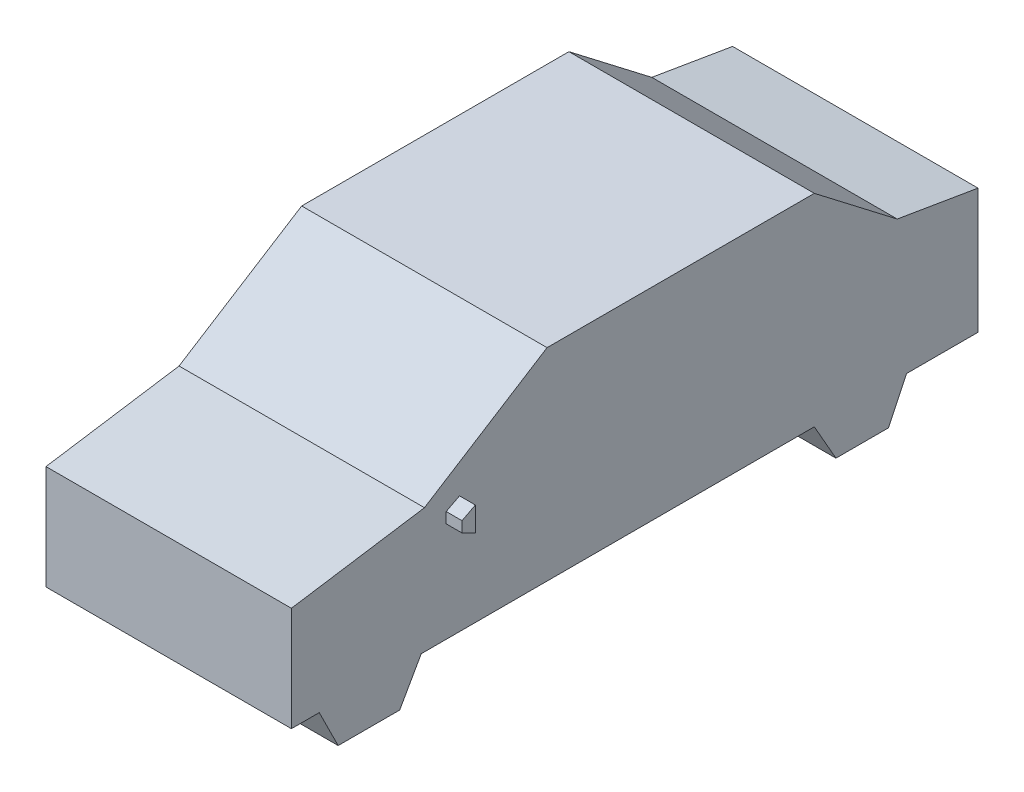
ISO-10303-21;
HEADER;
FILE_DESCRIPTION(('STEP AP214'),'2;1');
FILE_NAME('part.step','',(''),(''),'','','');
FILE_SCHEMA(('AUTOMOTIVE_DESIGN { 1 0 10303 214 1 1 1 1 }'));
ENDSEC;
DATA;
#1=APPLICATION_CONTEXT('core data for automotive mechanical design processes');
#2=APPLICATION_PROTOCOL_DEFINITION('international standard','automotive_design',2000,#1);
#3=PRODUCT_CONTEXT('',#1,'mechanical');
#4=PRODUCT('Part','Part','',(#3));
#5=PRODUCT_RELATED_PRODUCT_CATEGORY('part','',(#4));
#6=PRODUCT_DEFINITION_FORMATION('','',#4);
#7=PRODUCT_DEFINITION_CONTEXT('part definition',#1,'design');
#8=PRODUCT_DEFINITION('design','',#6,#7);
#9=PRODUCT_DEFINITION_SHAPE('','',#8);
#10=(LENGTH_UNIT() NAMED_UNIT(*) SI_UNIT(.MILLI.,.METRE.));
#11=(NAMED_UNIT(*) PLANE_ANGLE_UNIT() SI_UNIT($,.RADIAN.));
#12=(NAMED_UNIT(*) SI_UNIT($,.STERADIAN.) SOLID_ANGLE_UNIT());
#13=UNCERTAINTY_MEASURE_WITH_UNIT(LENGTH_MEASURE(1.E-05),#10,'distance_accuracy_value','');
#14=(GEOMETRIC_REPRESENTATION_CONTEXT(3) GLOBAL_UNCERTAINTY_ASSIGNED_CONTEXT((#13)) GLOBAL_UNIT_ASSIGNED_CONTEXT((#10,
#11,#12)) REPRESENTATION_CONTEXT('',''));
#15=CARTESIAN_POINT('',(0.,0.,0.));
#16=DIRECTION('',(0.,0.,1.));
#17=DIRECTION('',(1.,0.,0.));
#18=AXIS2_PLACEMENT_3D('',#15,#16,#17);
#19=CARTESIAN_POINT('',(1550.,0.,0.));
#20=DIRECTION('',(-1.,0.,0.));
#21=DIRECTION('',(0.,0.,1.));
#22=AXIS2_PLACEMENT_3D('',#19,#20,#21);
#23=PLANE('',#22);
#24=DIRECTION('',(0.,0.,-1.));
#25=VECTOR('',#24,1.);
#26=CARTESIAN_POINT('',(1550.,0.,-176.017340052614));
#27=LINE('',#26,#25);
#28=CARTESIAN_POINT('',(1550.,0.,0.));
#29=VERTEX_POINT('',#28);
#30=CARTESIAN_POINT('',(1550.,0.,-176.017340052614));
#31=VERTEX_POINT('',#30);
#32=EDGE_CURVE('E250',#29,#31,#27,.T.);
#33=ORIENTED_EDGE('',*,*,#32,.T.);
#34=DIRECTION('',(0.,-0.895377159311021,-0.445308592533454));
#35=VECTOR('',#34,1.);
#36=CARTESIAN_POINT('',(1550.,-240.,-295.379400047831));
#37=LINE('',#36,#35);
#38=CARTESIAN_POINT('',(1550.,-240.,-295.379400047831));
#39=VERTEX_POINT('',#38);
#40=EDGE_CURVE('E253',#31,#39,#37,.T.);
#41=ORIENTED_EDGE('',*,*,#40,.T.);
#42=DIRECTION('',(0.,0.,-1.));
#43=VECTOR('',#42,1.);
#44=CARTESIAN_POINT('',(1550.,-240.,-295.379400047831));
#45=LINE('',#44,#43);
#46=CARTESIAN_POINT('',(1550.,-240.,-684.047248406451));
#47=VERTEX_POINT('',#46);
#48=EDGE_CURVE('E256',#39,#47,#45,.T.);
#49=ORIENTED_EDGE('',*,*,#48,.T.);
#50=DIRECTION('',(0.,0.869910148903558,-0.493210231883513));
#51=VECTOR('',#50,1.);
#52=CARTESIAN_POINT('',(1550.,-240.,-684.047248406451));
#53=LINE('',#52,#51);
#54=CARTESIAN_POINT('',(1550.,0.,-820.119296538363));
#55=VERTEX_POINT('',#54);
#56=EDGE_CURVE('E258',#47,#55,#53,.T.);
#57=ORIENTED_EDGE('',*,*,#56,.T.);
#58=DIRECTION('',(0.,0.,-1.));
#59=VECTOR('',#58,1.);
#60=CARTESIAN_POINT('',(1550.,0.,-820.119296538363));
#61=LINE('',#60,#59);
#62=CARTESIAN_POINT('',(1550.,0.,-3302.78509929613));
#63=VERTEX_POINT('',#62);
#64=EDGE_CURVE('E260',#55,#63,#61,.T.);
#65=ORIENTED_EDGE('',*,*,#64,.T.);
#66=DIRECTION('',(0.,-0.868982423308208,-0.494842952846046));
#67=VECTOR('',#66,1.);
#68=CARTESIAN_POINT('',(1550.,0.,-3302.78509929613));
#69=LINE('',#68,#67);
#70=CARTESIAN_POINT('',(1550.,-240.,-3439.45335114745));
#71=VERTEX_POINT('',#70);
#72=EDGE_CURVE('E262',#63,#71,#69,.T.);
#73=ORIENTED_EDGE('',*,*,#72,.T.);
#74=DIRECTION('',(0.,0.,-1.));
#75=VECTOR('',#74,1.);
#76=CARTESIAN_POINT('',(1550.,-240.,-3439.45335114745));
#77=LINE('',#76,#75);
#78=CARTESIAN_POINT('',(1550.,-240.,-3771.2466763929));
#79=VERTEX_POINT('',#78);
#80=EDGE_CURVE('E264',#71,#79,#77,.T.);
#81=ORIENTED_EDGE('',*,*,#80,.T.);
#82=DIRECTION('',(0.,0.902092987098302,-0.431541704390273));
#83=VECTOR('',#82,1.);
#84=CARTESIAN_POINT('',(1550.,-240.,-3771.2466763929));
#85=LINE('',#84,#83);
#86=CARTESIAN_POINT('',(1550.,0.,-3886.0574670042));
#87=VERTEX_POINT('',#86);
#88=EDGE_CURVE('E266',#79,#87,#85,.T.);
#89=ORIENTED_EDGE('',*,*,#88,.T.);
#90=DIRECTION('',(0.,0.,-1.));
#91=VECTOR('',#90,1.);
#92=CARTESIAN_POINT('',(1550.,0.,-3886.0574670042));
#93=LINE('',#92,#91);
#94=CARTESIAN_POINT('',(1550.,0.,-4336.63771702875));
#95=VERTEX_POINT('',#94);
#96=EDGE_CURVE('E268',#87,#95,#93,.T.);
#97=ORIENTED_EDGE('',*,*,#96,.T.);
#98=DIRECTION('',(0.,1.,0.));
#99=VECTOR('',#98,1.);
#100=CARTESIAN_POINT('',(1550.,788.734761173703,-4336.63771702875));
#101=LINE('',#100,#99);
#102=CARTESIAN_POINT('',(1550.,788.734761173703,-4336.63771702875));
#103=VERTEX_POINT('',#102);
#104=EDGE_CURVE('E270',#95,#103,#101,.T.);
#105=ORIENTED_EDGE('',*,*,#104,.T.);
#106=DIRECTION('',(0.,0.16608532313048,0.986111385919787));
#107=VECTOR('',#106,1.);
#108=CARTESIAN_POINT('',(1550.,874.659150998905,-3826.47211336324));
#109=LINE('',#108,#107);
#110=CARTESIAN_POINT('',(1550.,874.659150998905,-3826.47211336324));
#111=VERTEX_POINT('',#110);
#112=EDGE_CURVE('E272',#103,#111,#109,.T.);
#113=ORIENTED_EDGE('',*,*,#112,.T.);
#114=DIRECTION('',(0.,0.609239447581311,0.79298631483199));
#115=VECTOR('',#114,1.);
#116=CARTESIAN_POINT('',(1550.,1277.,-3302.78509929613));
#117=LINE('',#116,#115);
#118=CARTESIAN_POINT('',(1550.,1277.,-3302.78509929613));
#119=VERTEX_POINT('',#118);
#120=EDGE_CURVE('E274',#111,#119,#117,.T.);
#121=ORIENTED_EDGE('',*,*,#120,.T.);
#122=DIRECTION('',(0.,0.,1.));
#123=VECTOR('',#122,1.);
#124=CARTESIAN_POINT('',(1550.,1277.,-1614.79322398012));
#125=LINE('',#124,#123);
#126=CARTESIAN_POINT('',(1550.,1277.,-1614.79322398012));
#127=VERTEX_POINT('',#126);
#128=EDGE_CURVE('E276',#119,#127,#125,.T.);
#129=ORIENTED_EDGE('',*,*,#128,.T.);
#130=DIRECTION('',(0.,-0.533371668331702,0.84588099838042));
#131=VECTOR('',#130,1.);
#132=CARTESIAN_POINT('',(1550.,788.731418709604,-840.441792244797));
#133=LINE('',#132,#131);
#134=CARTESIAN_POINT('',(1550.,788.731418709604,-840.441792244797));
#135=VERTEX_POINT('',#134);
#136=EDGE_CURVE('E278',#127,#135,#133,.T.);
#137=ORIENTED_EDGE('',*,*,#136,.T.);
#138=DIRECTION('',(0.,-0.152697032210845,0.98827304746917));
#139=VECTOR('',#138,1.);
#140=CARTESIAN_POINT('',(1550.,658.875638720069,0.));
#141=LINE('',#140,#139);
#142=CARTESIAN_POINT('',(1550.,658.875638720069,0.));
#143=VERTEX_POINT('',#142);
#144=EDGE_CURVE('E280',#135,#143,#141,.T.);
#145=ORIENTED_EDGE('',*,*,#144,.T.);
#146=DIRECTION('',(0.,-1.,0.));
#147=VECTOR('',#146,1.);
#148=CARTESIAN_POINT('',(1550.,0.,0.));
#149=LINE('',#148,#147);
#150=EDGE_CURVE('E282',#143,#29,#149,.T.);
#151=ORIENTED_EDGE('',*,*,#150,.T.);
#152=EDGE_LOOP('',(#33,#41,#49,#57,#65,#73,#81,#89,#97,#105,#113,#121,#129,#137,#145,#151));
#153=FACE_BOUND('',#152,.T.);
#154=DIRECTION('',(0.,-0.460706215100114,0.887552693291011));
#155=VECTOR('',#154,1.);
#156=CARTESIAN_POINT('',(1550.,150.970035417535,78.3647372561548));
#157=LINE('',#156,#155);
#158=CARTESIAN_POINT('',(1550.,742.845049310631,-1061.88526470728));
#159=VERTEX_POINT('',#158);
#160=CARTESIAN_POINT('',(1550.,699.136220919854,-977.6800009463));
#161=VERTEX_POINT('',#160);
#162=EDGE_CURVE('E247',#159,#161,#157,.T.);
#163=ORIENTED_EDGE('',*,*,#162,.F.);
#164=DIRECTION('',(0.,1.,0.));
#165=VECTOR('',#164,1.);
#166=CARTESIAN_POINT('',(1550.,0.,-1061.88526470728));
#167=LINE('',#166,#165);
#168=CARTESIAN_POINT('',(1550.,590.64563158563,-1061.88526470728));
#169=VERTEX_POINT('',#168);
#170=EDGE_CURVE('E242',#169,#159,#167,.T.);
#171=ORIENTED_EDGE('',*,*,#170,.F.);
#172=DIRECTION('',(0.,-0.438928983799686,-0.898521756653992));
#173=VECTOR('',#172,1.);
#174=CARTESIAN_POINT('',(1550.,895.646640322447,-437.524485933757));
#175=LINE('',#174,#173);
#176=CARTESIAN_POINT('',(1550.,631.780006551494,-977.6800009463));
#177=VERTEX_POINT('',#176);
#178=EDGE_CURVE('E54',#177,#169,#175,.T.);
#179=ORIENTED_EDGE('',*,*,#178,.F.);
#180=DIRECTION('',(0.,-1.,0.));
#181=VECTOR('',#180,1.);
#182=CARTESIAN_POINT('',(1550.,0.,-977.6800009463));
#183=LINE('',#182,#181);
#184=EDGE_CURVE('E49',#161,#177,#183,.T.);
#185=ORIENTED_EDGE('',*,*,#184,.F.);
#186=EDGE_LOOP('',(#163,#171,#179,#185));
#187=FACE_BOUND('',#186,.T.);
#188=ADVANCED_FACE('F34',(#153,#187),#23,.F.);
#189=CARTESIAN_POINT('',(0.,0.,0.));
#190=DIRECTION('',(-1.,0.,0.));
#191=DIRECTION('',(0.,0.,1.));
#192=AXIS2_PLACEMENT_3D('',#189,#190,#191);
#193=PLANE('',#192);
#194=DIRECTION('',(0.,0.,-1.));
#195=VECTOR('',#194,1.);
#196=CARTESIAN_POINT('',(0.,0.,-176.017340052614));
#197=LINE('',#196,#195);
#198=CARTESIAN_POINT('',(0.,0.,0.));
#199=VERTEX_POINT('',#198);
#200=CARTESIAN_POINT('',(0.,0.,-176.017340052614));
#201=VERTEX_POINT('',#200);
#202=EDGE_CURVE('E249',#199,#201,#197,.T.);
#203=ORIENTED_EDGE('',*,*,#202,.F.);
#204=DIRECTION('',(0.,-1.,0.));
#205=VECTOR('',#204,1.);
#206=CARTESIAN_POINT('',(0.,0.,0.));
#207=LINE('',#206,#205);
#208=CARTESIAN_POINT('',(0.,658.875638720069,0.));
#209=VERTEX_POINT('',#208);
#210=EDGE_CURVE('E254',#209,#199,#207,.T.);
#211=ORIENTED_EDGE('',*,*,#210,.F.);
#212=DIRECTION('',(0.,-0.152697032210845,0.98827304746917));
#213=VECTOR('',#212,1.);
#214=CARTESIAN_POINT('',(0.,658.875638720069,0.));
#215=LINE('',#214,#213);
#216=CARTESIAN_POINT('',(0.,788.731418709604,-840.441792244797));
#217=VERTEX_POINT('',#216);
#218=EDGE_CURVE('E313',#217,#209,#215,.T.);
#219=ORIENTED_EDGE('',*,*,#218,.F.);
#220=DIRECTION('',(0.,-0.533371668331702,0.84588099838042));
#221=VECTOR('',#220,1.);
#222=CARTESIAN_POINT('',(0.,788.731418709604,-840.441792244797));
#223=LINE('',#222,#221);
#224=CARTESIAN_POINT('',(0.,1277.,-1614.79322398012));
#225=VERTEX_POINT('',#224);
#226=EDGE_CURVE('E311',#225,#217,#223,.T.);
#227=ORIENTED_EDGE('',*,*,#226,.F.);
#228=DIRECTION('',(0.,0.,1.));
#229=VECTOR('',#228,1.);
#230=CARTESIAN_POINT('',(0.,1277.,-1614.79322398012));
#231=LINE('',#230,#229);
#232=CARTESIAN_POINT('',(0.,1277.,-3302.78509929613));
#233=VERTEX_POINT('',#232);
#234=EDGE_CURVE('E309',#233,#225,#231,.T.);
#235=ORIENTED_EDGE('',*,*,#234,.F.);
#236=DIRECTION('',(0.,0.609239447581311,0.79298631483199));
#237=VECTOR('',#236,1.);
#238=CARTESIAN_POINT('',(0.,1277.,-3302.78509929613));
#239=LINE('',#238,#237);
#240=CARTESIAN_POINT('',(0.,874.659150998905,-3826.47211336324));
#241=VERTEX_POINT('',#240);
#242=EDGE_CURVE('E307',#241,#233,#239,.T.);
#243=ORIENTED_EDGE('',*,*,#242,.F.);
#244=DIRECTION('',(0.,0.16608532313048,0.986111385919787));
#245=VECTOR('',#244,1.);
#246=CARTESIAN_POINT('',(0.,874.659150998905,-3826.47211336324));
#247=LINE('',#246,#245);
#248=CARTESIAN_POINT('',(0.,788.734761173703,-4336.63771702875));
#249=VERTEX_POINT('',#248);
#250=EDGE_CURVE('E305',#249,#241,#247,.T.);
#251=ORIENTED_EDGE('',*,*,#250,.F.);
#252=DIRECTION('',(0.,1.,0.));
#253=VECTOR('',#252,1.);
#254=CARTESIAN_POINT('',(0.,788.734761173703,-4336.63771702875));
#255=LINE('',#254,#253);
#256=CARTESIAN_POINT('',(0.,0.,-4336.63771702875));
#257=VERTEX_POINT('',#256);
#258=EDGE_CURVE('E303',#257,#249,#255,.T.);
#259=ORIENTED_EDGE('',*,*,#258,.F.);
#260=DIRECTION('',(0.,0.,-1.));
#261=VECTOR('',#260,1.);
#262=CARTESIAN_POINT('',(0.,0.,-3886.0574670042));
#263=LINE('',#262,#261);
#264=CARTESIAN_POINT('',(0.,0.,-3886.0574670042));
#265=VERTEX_POINT('',#264);
#266=EDGE_CURVE('E301',#265,#257,#263,.T.);
#267=ORIENTED_EDGE('',*,*,#266,.F.);
#268=DIRECTION('',(0.,0.902092987098302,-0.431541704390273));
#269=VECTOR('',#268,1.);
#270=CARTESIAN_POINT('',(0.,-240.,-3771.2466763929));
#271=LINE('',#270,#269);
#272=CARTESIAN_POINT('',(0.,-240.,-3771.2466763929));
#273=VERTEX_POINT('',#272);
#274=EDGE_CURVE('E299',#273,#265,#271,.T.);
#275=ORIENTED_EDGE('',*,*,#274,.F.);
#276=DIRECTION('',(0.,0.,-1.));
#277=VECTOR('',#276,1.);
#278=CARTESIAN_POINT('',(0.,-240.,-3439.45335114745));
#279=LINE('',#278,#277);
#280=CARTESIAN_POINT('',(0.,-240.,-3439.45335114745));
#281=VERTEX_POINT('',#280);
#282=EDGE_CURVE('E297',#281,#273,#279,.T.);
#283=ORIENTED_EDGE('',*,*,#282,.F.);
#284=DIRECTION('',(0.,-0.868982423308208,-0.494842952846046));
#285=VECTOR('',#284,1.);
#286=CARTESIAN_POINT('',(0.,0.,-3302.78509929613));
#287=LINE('',#286,#285);
#288=CARTESIAN_POINT('',(0.,0.,-3302.78509929613));
#289=VERTEX_POINT('',#288);
#290=EDGE_CURVE('E295',#289,#281,#287,.T.);
#291=ORIENTED_EDGE('',*,*,#290,.F.);
#292=DIRECTION('',(0.,0.,-1.));
#293=VECTOR('',#292,1.);
#294=CARTESIAN_POINT('',(0.,0.,-820.119296538363));
#295=LINE('',#294,#293);
#296=CARTESIAN_POINT('',(0.,0.,-820.119296538363));
#297=VERTEX_POINT('',#296);
#298=EDGE_CURVE('E293',#297,#289,#295,.T.);
#299=ORIENTED_EDGE('',*,*,#298,.F.);
#300=DIRECTION('',(0.,0.869910148903558,-0.493210231883513));
#301=VECTOR('',#300,1.);
#302=CARTESIAN_POINT('',(0.,-240.,-684.047248406451));
#303=LINE('',#302,#301);
#304=CARTESIAN_POINT('',(0.,-240.,-684.047248406451));
#305=VERTEX_POINT('',#304);
#306=EDGE_CURVE('E291',#305,#297,#303,.T.);
#307=ORIENTED_EDGE('',*,*,#306,.F.);
#308=DIRECTION('',(0.,0.,-1.));
#309=VECTOR('',#308,1.);
#310=CARTESIAN_POINT('',(0.,-240.,-295.379400047831));
#311=LINE('',#310,#309);
#312=CARTESIAN_POINT('',(0.,-240.,-295.379400047831));
#313=VERTEX_POINT('',#312);
#314=EDGE_CURVE('E289',#313,#305,#311,.T.);
#315=ORIENTED_EDGE('',*,*,#314,.F.);
#316=DIRECTION('',(0.,-0.895377159311021,-0.445308592533454));
#317=VECTOR('',#316,1.);
#318=CARTESIAN_POINT('',(0.,-240.,-295.379400047831));
#319=LINE('',#318,#317);
#320=EDGE_CURVE('E287',#201,#313,#319,.T.);
#321=ORIENTED_EDGE('',*,*,#320,.F.);
#322=EDGE_LOOP('',(#203,#211,#219,#227,#235,#243,#251,#259,#267,#275,#283,#291,#299,#307,#315,#321));
#323=FACE_BOUND('',#322,.T.);
#324=DIRECTION('',(0.,1.,0.));
#325=VECTOR('',#324,1.);
#326=CARTESIAN_POINT('',(0.,0.,-1061.88526470728));
#327=LINE('',#326,#325);
#328=CARTESIAN_POINT('',(0.,590.64563158563,-1061.88526470728));
#329=VERTEX_POINT('',#328);
#330=CARTESIAN_POINT('',(0.,742.845049310631,-1061.88526470728));
#331=VERTEX_POINT('',#330);
#332=EDGE_CURVE('E363',#329,#331,#327,.T.);
#333=ORIENTED_EDGE('',*,*,#332,.T.);
#334=DIRECTION('',(0.,-0.460706215100114,0.887552693291011));
#335=VECTOR('',#334,1.);
#336=CARTESIAN_POINT('',(0.,150.970035417535,78.3647372561548));
#337=LINE('',#336,#335);
#338=CARTESIAN_POINT('',(0.,699.136220919854,-977.6800009463));
#339=VERTEX_POINT('',#338);
#340=EDGE_CURVE('E11',#331,#339,#337,.T.);
#341=ORIENTED_EDGE('',*,*,#340,.T.);
#342=DIRECTION('',(0.,-1.,0.));
#343=VECTOR('',#342,1.);
#344=CARTESIAN_POINT('',(0.,0.,-977.6800009463));
#345=LINE('',#344,#343);
#346=CARTESIAN_POINT('',(0.,631.780006551494,-977.6800009463));
#347=VERTEX_POINT('',#346);
#348=EDGE_CURVE('E42',#339,#347,#345,.T.);
#349=ORIENTED_EDGE('',*,*,#348,.T.);
#350=DIRECTION('',(0.,-0.438928983799686,-0.898521756653992));
#351=VECTOR('',#350,1.);
#352=CARTESIAN_POINT('',(0.,895.646640322447,-437.524485933757));
#353=LINE('',#352,#351);
#354=EDGE_CURVE('E366',#347,#329,#353,.T.);
#355=ORIENTED_EDGE('',*,*,#354,.T.);
#356=EDGE_LOOP('',(#333,#341,#349,#355));
#357=FACE_BOUND('',#356,.T.);
#358=ADVANCED_FACE('F369',(#323,#357),#193,.T.);
#359=CARTESIAN_POINT('',(1550.,0.,-176.017340052614));
#360=DIRECTION('',(0.,1.,0.));
#361=DIRECTION('',(0.,0.,1.));
#362=AXIS2_PLACEMENT_3D('',#359,#360,#361);
#363=PLANE('',#362);
#364=ORIENTED_EDGE('',*,*,#202,.T.);
#365=DIRECTION('',(-1.,0.,0.));
#366=VECTOR('',#365,1.);
#367=CARTESIAN_POINT('',(1550.,0.,-176.017340052614));
#368=LINE('',#367,#366);
#369=EDGE_CURVE('E360',#31,#201,#368,.T.);
#370=ORIENTED_EDGE('',*,*,#369,.F.);
#371=ORIENTED_EDGE('',*,*,#32,.F.);
#372=DIRECTION('',(-1.,0.,0.));
#373=VECTOR('',#372,1.);
#374=CARTESIAN_POINT('',(1550.,0.,0.));
#375=LINE('',#374,#373);
#376=EDGE_CURVE('E284',#29,#199,#375,.T.);
#377=ORIENTED_EDGE('',*,*,#376,.T.);
#378=EDGE_LOOP('',(#364,#370,#371,#377));
#379=FACE_BOUND('',#378,.T.);
#380=ADVANCED_FACE('F36',(#379),#363,.F.);
#381=CARTESIAN_POINT('',(1550.,-240.,-295.379400047831));
#382=DIRECTION('',(0.,0.445308592533454,-0.895377159311021));
#383=DIRECTION('',(0.,0.895377159311021,0.445308592533454));
#384=AXIS2_PLACEMENT_3D('',#381,#382,#383);
#385=PLANE('',#384);
#386=ORIENTED_EDGE('',*,*,#320,.T.);
#387=DIRECTION('',(-1.,0.,0.));
#388=VECTOR('',#387,1.);
#389=CARTESIAN_POINT('',(1550.,-240.,-295.379400047831));
#390=LINE('',#389,#388);
#391=EDGE_CURVE('E357',#39,#313,#390,.T.);
#392=ORIENTED_EDGE('',*,*,#391,.F.);
#393=ORIENTED_EDGE('',*,*,#40,.F.);
#394=ORIENTED_EDGE('',*,*,#369,.T.);
#395=EDGE_LOOP('',(#386,#392,#393,#394));
#396=FACE_BOUND('',#395,.T.);
#397=ADVANCED_FACE('F452',(#396),#385,.F.);
#398=CARTESIAN_POINT('',(1550.,-240.,-295.379400047831));
#399=DIRECTION('',(0.,1.,0.));
#400=DIRECTION('',(0.,0.,1.));
#401=AXIS2_PLACEMENT_3D('',#398,#399,#400);
#402=PLANE('',#401);
#403=ORIENTED_EDGE('',*,*,#314,.T.);
#404=DIRECTION('',(-1.,0.,0.));
#405=VECTOR('',#404,1.);
#406=CARTESIAN_POINT('',(1550.,-240.,-684.047248406451));
#407=LINE('',#406,#405);
#408=EDGE_CURVE('E354',#47,#305,#407,.T.);
#409=ORIENTED_EDGE('',*,*,#408,.F.);
#410=ORIENTED_EDGE('',*,*,#48,.F.);
#411=ORIENTED_EDGE('',*,*,#391,.T.);
#412=EDGE_LOOP('',(#403,#409,#410,#411));
#413=FACE_BOUND('',#412,.T.);
#414=ADVANCED_FACE('F449',(#413),#402,.F.);
#415=CARTESIAN_POINT('',(1550.,-240.,-684.047248406451));
#416=DIRECTION('',(0.,0.493210231883513,0.869910148903558));
#417=DIRECTION('',(0.,-0.869910148903559,0.493210231883513));
#418=AXIS2_PLACEMENT_3D('',#415,#416,#417);
#419=PLANE('',#418);
#420=ORIENTED_EDGE('',*,*,#306,.T.);
#421=DIRECTION('',(-1.,0.,0.));
#422=VECTOR('',#421,1.);
#423=CARTESIAN_POINT('',(1550.,0.,-820.119296538363));
#424=LINE('',#423,#422);
#425=EDGE_CURVE('E351',#55,#297,#424,.T.);
#426=ORIENTED_EDGE('',*,*,#425,.F.);
#427=ORIENTED_EDGE('',*,*,#56,.F.);
#428=ORIENTED_EDGE('',*,*,#408,.T.);
#429=EDGE_LOOP('',(#420,#426,#427,#428));
#430=FACE_BOUND('',#429,.T.);
#431=ADVANCED_FACE('F445',(#430),#419,.F.);
#432=CARTESIAN_POINT('',(1550.,0.,-820.119296538363));
#433=DIRECTION('',(0.,1.,0.));
#434=DIRECTION('',(0.,0.,1.));
#435=AXIS2_PLACEMENT_3D('',#432,#433,#434);
#436=PLANE('',#435);
#437=ORIENTED_EDGE('',*,*,#298,.T.);
#438=DIRECTION('',(-1.,0.,0.));
#439=VECTOR('',#438,1.);
#440=CARTESIAN_POINT('',(1550.,0.,-3302.78509929613));
#441=LINE('',#440,#439);
#442=EDGE_CURVE('E348',#63,#289,#441,.T.);
#443=ORIENTED_EDGE('',*,*,#442,.F.);
#444=ORIENTED_EDGE('',*,*,#64,.F.);
#445=ORIENTED_EDGE('',*,*,#425,.T.);
#446=EDGE_LOOP('',(#437,#443,#444,#445));
#447=FACE_BOUND('',#446,.T.);
#448=ADVANCED_FACE('F441',(#447),#436,.F.);
#449=CARTESIAN_POINT('',(1550.,0.,-3302.78509929613));
#450=DIRECTION('',(0.,0.494842952846047,-0.868982423308208));
#451=DIRECTION('',(0.,0.868982423308208,0.494842952846047));
#452=AXIS2_PLACEMENT_3D('',#449,#450,#451);
#453=PLANE('',#452);
#454=ORIENTED_EDGE('',*,*,#290,.T.);
#455=DIRECTION('',(-1.,0.,0.));
#456=VECTOR('',#455,1.);
#457=CARTESIAN_POINT('',(1550.,-240.,-3439.45335114745));
#458=LINE('',#457,#456);
#459=EDGE_CURVE('E345',#71,#281,#458,.T.);
#460=ORIENTED_EDGE('',*,*,#459,.F.);
#461=ORIENTED_EDGE('',*,*,#72,.F.);
#462=ORIENTED_EDGE('',*,*,#442,.T.);
#463=EDGE_LOOP('',(#454,#460,#461,#462));
#464=FACE_BOUND('',#463,.T.);
#465=ADVANCED_FACE('F437',(#464),#453,.F.);
#466=CARTESIAN_POINT('',(1550.,-240.,-3439.45335114745));
#467=DIRECTION('',(0.,1.,0.));
#468=DIRECTION('',(0.,0.,1.));
#469=AXIS2_PLACEMENT_3D('',#466,#467,#468);
#470=PLANE('',#469);
#471=ORIENTED_EDGE('',*,*,#282,.T.);
#472=DIRECTION('',(-1.,0.,0.));
#473=VECTOR('',#472,1.);
#474=CARTESIAN_POINT('',(1550.,-240.,-3771.2466763929));
#475=LINE('',#474,#473);
#476=EDGE_CURVE('E342',#79,#273,#475,.T.);
#477=ORIENTED_EDGE('',*,*,#476,.F.);
#478=ORIENTED_EDGE('',*,*,#80,.F.);
#479=ORIENTED_EDGE('',*,*,#459,.T.);
#480=EDGE_LOOP('',(#471,#477,#478,#479));
#481=FACE_BOUND('',#480,.T.);
#482=ADVANCED_FACE('F433',(#481),#470,.F.);
#483=CARTESIAN_POINT('',(1550.,-240.,-3771.2466763929));
#484=DIRECTION('',(0.,0.431541704390273,0.902092987098302));
#485=DIRECTION('',(0.,-0.902092987098302,0.431541704390273));
#486=AXIS2_PLACEMENT_3D('',#483,#484,#485);
#487=PLANE('',#486);
#488=ORIENTED_EDGE('',*,*,#274,.T.);
#489=DIRECTION('',(-1.,0.,0.));
#490=VECTOR('',#489,1.);
#491=CARTESIAN_POINT('',(1550.,0.,-3886.0574670042));
#492=LINE('',#491,#490);
#493=EDGE_CURVE('E339',#87,#265,#492,.T.);
#494=ORIENTED_EDGE('',*,*,#493,.F.);
#495=ORIENTED_EDGE('',*,*,#88,.F.);
#496=ORIENTED_EDGE('',*,*,#476,.T.);
#497=EDGE_LOOP('',(#488,#494,#495,#496));
#498=FACE_BOUND('',#497,.T.);
#499=ADVANCED_FACE('F429',(#498),#487,.F.);
#500=CARTESIAN_POINT('',(1550.,0.,-3886.0574670042));
#501=DIRECTION('',(0.,1.,0.));
#502=DIRECTION('',(0.,0.,1.));
#503=AXIS2_PLACEMENT_3D('',#500,#501,#502);
#504=PLANE('',#503);
#505=ORIENTED_EDGE('',*,*,#266,.T.);
#506=DIRECTION('',(-1.,0.,0.));
#507=VECTOR('',#506,1.);
#508=CARTESIAN_POINT('',(1550.,0.,-4336.63771702875));
#509=LINE('',#508,#507);
#510=EDGE_CURVE('E336',#95,#257,#509,.T.);
#511=ORIENTED_EDGE('',*,*,#510,.F.);
#512=ORIENTED_EDGE('',*,*,#96,.F.);
#513=ORIENTED_EDGE('',*,*,#493,.T.);
#514=EDGE_LOOP('',(#505,#511,#512,#513));
#515=FACE_BOUND('',#514,.T.);
#516=ADVANCED_FACE('F425',(#515),#504,.F.);
#517=CARTESIAN_POINT('',(1550.,788.734761173703,-4336.63771702875));
#518=DIRECTION('',(0.,0.,1.));
#519=DIRECTION('',(1.,0.,0.));
#520=AXIS2_PLACEMENT_3D('',#517,#518,#519);
#521=PLANE('',#520);
#522=ORIENTED_EDGE('',*,*,#258,.T.);
#523=DIRECTION('',(-1.,0.,0.));
#524=VECTOR('',#523,1.);
#525=CARTESIAN_POINT('',(1550.,788.734761173703,-4336.63771702875));
#526=LINE('',#525,#524);
#527=EDGE_CURVE('E333',#103,#249,#526,.T.);
#528=ORIENTED_EDGE('',*,*,#527,.F.);
#529=ORIENTED_EDGE('',*,*,#104,.F.);
#530=ORIENTED_EDGE('',*,*,#510,.T.);
#531=EDGE_LOOP('',(#522,#528,#529,#530));
#532=FACE_BOUND('',#531,.T.);
#533=ADVANCED_FACE('F421',(#532),#521,.F.);
#534=CARTESIAN_POINT('',(1550.,874.659150998905,-3826.47211336324));
#535=DIRECTION('',(0.,-0.986111385919788,0.16608532313048));
#536=DIRECTION('',(0.,-0.16608532313048,-0.986111385919788));
#537=AXIS2_PLACEMENT_3D('',#534,#535,#536);
#538=PLANE('',#537);
#539=ORIENTED_EDGE('',*,*,#250,.T.);
#540=DIRECTION('',(-1.,0.,0.));
#541=VECTOR('',#540,1.);
#542=CARTESIAN_POINT('',(1550.,874.659150998905,-3826.47211336324));
#543=LINE('',#542,#541);
#544=EDGE_CURVE('E330',#111,#241,#543,.T.);
#545=ORIENTED_EDGE('',*,*,#544,.F.);
#546=ORIENTED_EDGE('',*,*,#112,.F.);
#547=ORIENTED_EDGE('',*,*,#527,.T.);
#548=EDGE_LOOP('',(#539,#545,#546,#547));
#549=FACE_BOUND('',#548,.T.);
#550=ADVANCED_FACE('F417',(#549),#538,.F.);
#551=CARTESIAN_POINT('',(1550.,1277.,-3302.78509929613));
#552=DIRECTION('',(0.,-0.79298631483199,0.609239447581311));
#553=DIRECTION('',(0.,-0.609239447581311,-0.79298631483199));
#554=AXIS2_PLACEMENT_3D('',#551,#552,#553);
#555=PLANE('',#554);
#556=ORIENTED_EDGE('',*,*,#242,.T.);
#557=DIRECTION('',(-1.,0.,0.));
#558=VECTOR('',#557,1.);
#559=CARTESIAN_POINT('',(1550.,1277.,-3302.78509929613));
#560=LINE('',#559,#558);
#561=EDGE_CURVE('E327',#119,#233,#560,.T.);
#562=ORIENTED_EDGE('',*,*,#561,.F.);
#563=ORIENTED_EDGE('',*,*,#120,.F.);
#564=ORIENTED_EDGE('',*,*,#544,.T.);
#565=EDGE_LOOP('',(#556,#562,#563,#564));
#566=FACE_BOUND('',#565,.T.);
#567=ADVANCED_FACE('F413',(#566),#555,.F.);
#568=CARTESIAN_POINT('',(1550.,1277.,-1614.79322398012));
#569=DIRECTION('',(0.,-1.,0.));
#570=DIRECTION('',(0.,0.,-1.));
#571=AXIS2_PLACEMENT_3D('',#568,#569,#570);
#572=PLANE('',#571);
#573=ORIENTED_EDGE('',*,*,#234,.T.);
#574=DIRECTION('',(-1.,0.,0.));
#575=VECTOR('',#574,1.);
#576=CARTESIAN_POINT('',(1550.,1277.,-1614.79322398012));
#577=LINE('',#576,#575);
#578=EDGE_CURVE('E324',#127,#225,#577,.T.);
#579=ORIENTED_EDGE('',*,*,#578,.F.);
#580=ORIENTED_EDGE('',*,*,#128,.F.);
#581=ORIENTED_EDGE('',*,*,#561,.T.);
#582=EDGE_LOOP('',(#573,#579,#580,#581));
#583=FACE_BOUND('',#582,.T.);
#584=ADVANCED_FACE('F409',(#583),#572,.F.);
#585=CARTESIAN_POINT('',(1550.,788.731418709604,-840.441792244797));
#586=DIRECTION('',(0.,-0.84588099838042,-0.533371668331702));
#587=DIRECTION('',(0.,0.533371668331702,-0.84588099838042));
#588=AXIS2_PLACEMENT_3D('',#585,#586,#587);
#589=PLANE('',#588);
#590=ORIENTED_EDGE('',*,*,#226,.T.);
#591=DIRECTION('',(-1.,0.,0.));
#592=VECTOR('',#591,1.);
#593=CARTESIAN_POINT('',(1550.,788.731418709604,-840.441792244797));
#594=LINE('',#593,#592);
#595=EDGE_CURVE('E321',#135,#217,#594,.T.);
#596=ORIENTED_EDGE('',*,*,#595,.F.);
#597=ORIENTED_EDGE('',*,*,#136,.F.);
#598=ORIENTED_EDGE('',*,*,#578,.T.);
#599=EDGE_LOOP('',(#590,#596,#597,#598));
#600=FACE_BOUND('',#599,.T.);
#601=ADVANCED_FACE('F405',(#600),#589,.F.);
#602=CARTESIAN_POINT('',(1550.,658.875638720069,0.));
#603=DIRECTION('',(0.,-0.98827304746917,-0.152697032210845));
#604=DIRECTION('',(0.,0.152697032210845,-0.98827304746917));
#605=AXIS2_PLACEMENT_3D('',#602,#603,#604);
#606=PLANE('',#605);
#607=ORIENTED_EDGE('',*,*,#218,.T.);
#608=DIRECTION('',(-1.,0.,0.));
#609=VECTOR('',#608,1.);
#610=CARTESIAN_POINT('',(1550.,658.875638720069,0.));
#611=LINE('',#610,#609);
#612=EDGE_CURVE('E318',#143,#209,#611,.T.);
#613=ORIENTED_EDGE('',*,*,#612,.F.);
#614=ORIENTED_EDGE('',*,*,#144,.F.);
#615=ORIENTED_EDGE('',*,*,#595,.T.);
#616=EDGE_LOOP('',(#607,#613,#614,#615));
#617=FACE_BOUND('',#616,.T.);
#618=ADVANCED_FACE('F401',(#617),#606,.F.);
#619=CARTESIAN_POINT('',(1550.,0.,0.));
#620=DIRECTION('',(0.,0.,-1.));
#621=DIRECTION('',(-1.,0.,0.));
#622=AXIS2_PLACEMENT_3D('',#619,#620,#621);
#623=PLANE('',#622);
#624=ORIENTED_EDGE('',*,*,#210,.T.);
#625=ORIENTED_EDGE('',*,*,#376,.F.);
#626=ORIENTED_EDGE('',*,*,#150,.F.);
#627=ORIENTED_EDGE('',*,*,#612,.T.);
#628=EDGE_LOOP('',(#624,#625,#626,#627));
#629=FACE_BOUND('',#628,.T.);
#630=ADVANCED_FACE('F398',(#629),#623,.F.);
#631=CARTESIAN_POINT('',(-100.000000000001,0.,0.));
#632=DIRECTION('',(1.,0.,0.));
#633=DIRECTION('',(0.,0.,-1.));
#634=AXIS2_PLACEMENT_3D('',#631,#632,#633);
#635=PLANE('',#634);
#636=DIRECTION('',(0.,-0.460706215100114,0.887552693291011));
#637=VECTOR('',#636,1.);
#638=CARTESIAN_POINT('',(-100.,742.845049310631,-1061.88526470728));
#639=LINE('',#638,#637);
#640=CARTESIAN_POINT('',(-100.,742.845049310631,-1061.88526470728));
#641=VERTEX_POINT('',#640);
#642=CARTESIAN_POINT('',(-100.,699.136220919854,-977.6800009463));
#643=VERTEX_POINT('',#642);
#644=EDGE_CURVE('E210',#641,#643,#639,.T.);
#645=ORIENTED_EDGE('',*,*,#644,.F.);
#646=DIRECTION('',(0.,1.,0.));
#647=VECTOR('',#646,1.);
#648=CARTESIAN_POINT('',(-100.,590.64563158563,-1061.88526470728));
#649=LINE('',#648,#647);
#650=CARTESIAN_POINT('',(-100.,590.64563158563,-1061.88526470728));
#651=VERTEX_POINT('',#650);
#652=EDGE_CURVE('E220',#651,#641,#649,.T.);
#653=ORIENTED_EDGE('',*,*,#652,.F.);
#654=DIRECTION('',(0.,-0.438928983799686,-0.898521756653992));
#655=VECTOR('',#654,1.);
#656=CARTESIAN_POINT('',(-100.,631.780006551494,-977.6800009463));
#657=LINE('',#656,#655);
#658=CARTESIAN_POINT('',(-100.,631.780006551494,-977.6800009463));
#659=VERTEX_POINT('',#658);
#660=EDGE_CURVE('E213',#659,#651,#657,.T.);
#661=ORIENTED_EDGE('',*,*,#660,.F.);
#662=DIRECTION('',(0.,-1.,0.));
#663=VECTOR('',#662,1.);
#664=CARTESIAN_POINT('',(-100.,699.136220919854,-977.6800009463));
#665=LINE('',#664,#663);
#666=EDGE_CURVE('E197',#643,#659,#665,.T.);
#667=ORIENTED_EDGE('',*,*,#666,.F.);
#668=EDGE_LOOP('',(#645,#653,#661,#667));
#669=FACE_BOUND('',#668,.T.);
#670=ADVANCED_FACE('F208',(#669),#635,.F.);
#671=CARTESIAN_POINT('',(1650.,590.64563158563,-1061.88526470728));
#672=DIRECTION('',(0.,0.,1.));
#673=DIRECTION('',(1.,0.,0.));
#674=AXIS2_PLACEMENT_3D('',#671,#672,#673);
#675=PLANE('',#674);
#676=ORIENTED_EDGE('',*,*,#332,.F.);
#677=DIRECTION('',(-1.,0.,0.));
#678=VECTOR('',#677,1.);
#679=CARTESIAN_POINT('',(1650.,590.64563158563,-1061.88526470728));
#680=LINE('',#679,#678);
#681=EDGE_CURVE('E234',#329,#651,#680,.T.);
#682=ORIENTED_EDGE('',*,*,#681,.T.);
#683=ORIENTED_EDGE('',*,*,#652,.T.);
#684=DIRECTION('',(-1.,0.,0.));
#685=VECTOR('',#684,1.);
#686=CARTESIAN_POINT('',(1650.,742.845049310631,-1061.88526470728));
#687=LINE('',#686,#685);
#688=EDGE_CURVE('E216',#331,#641,#687,.T.);
#689=ORIENTED_EDGE('',*,*,#688,.F.);
#690=EDGE_LOOP('',(#676,#682,#683,#689));
#691=FACE_BOUND('',#690,.T.);
#692=ADVANCED_FACE('F372',(#691),#675,.F.);
#693=CARTESIAN_POINT('',(1650.,631.780006551494,-977.6800009463));
#694=DIRECTION('',(0.,0.898521756653992,-0.438928983799686));
#695=DIRECTION('',(0.,0.438928983799686,0.898521756653992));
#696=AXIS2_PLACEMENT_3D('',#693,#694,#695);
#697=PLANE('',#696);
#698=ORIENTED_EDGE('',*,*,#354,.F.);
#699=DIRECTION('',(-1.,0.,0.));
#700=VECTOR('',#699,1.);
#701=CARTESIAN_POINT('',(1650.,631.780006551494,-977.6800009463));
#702=LINE('',#701,#700);
#703=EDGE_CURVE('E238',#347,#659,#702,.T.);
#704=ORIENTED_EDGE('',*,*,#703,.T.);
#705=ORIENTED_EDGE('',*,*,#660,.T.);
#706=ORIENTED_EDGE('',*,*,#681,.F.);
#707=EDGE_LOOP('',(#698,#704,#705,#706));
#708=FACE_BOUND('',#707,.T.);
#709=ADVANCED_FACE('F374',(#708),#697,.F.);
#710=CARTESIAN_POINT('',(1650.,699.136220919854,-977.6800009463));
#711=DIRECTION('',(0.,0.,-1.));
#712=DIRECTION('',(-1.,0.,0.));
#713=AXIS2_PLACEMENT_3D('',#710,#711,#712);
#714=PLANE('',#713);
#715=ORIENTED_EDGE('',*,*,#348,.F.);
#716=DIRECTION('',(-1.,0.,0.));
#717=VECTOR('',#716,1.);
#718=CARTESIAN_POINT('',(1650.,699.136220919854,-977.6800009463));
#719=LINE('',#718,#717);
#720=EDGE_CURVE('E193',#339,#643,#719,.T.);
#721=ORIENTED_EDGE('',*,*,#720,.T.);
#722=ORIENTED_EDGE('',*,*,#666,.T.);
#723=ORIENTED_EDGE('',*,*,#703,.F.);
#724=EDGE_LOOP('',(#715,#721,#722,#723));
#725=FACE_BOUND('',#724,.T.);
#726=ADVANCED_FACE('F195',(#725),#714,.F.);
#727=CARTESIAN_POINT('',(1650.,742.845049310631,-1061.88526470728));
#728=DIRECTION('',(0.,-0.887552693291011,-0.460706215100114));
#729=DIRECTION('',(0.,0.460706215100114,-0.887552693291011));
#730=AXIS2_PLACEMENT_3D('',#727,#728,#729);
#731=PLANE('',#730);
#732=ORIENTED_EDGE('',*,*,#340,.F.);
#733=ORIENTED_EDGE('',*,*,#688,.T.);
#734=ORIENTED_EDGE('',*,*,#644,.T.);
#735=ORIENTED_EDGE('',*,*,#720,.F.);
#736=EDGE_LOOP('',(#732,#733,#734,#735));
#737=FACE_BOUND('',#736,.T.);
#738=ADVANCED_FACE('F215',(#737),#731,.F.);
#739=CARTESIAN_POINT('',(1650.,742.845049310631,-1061.88526470728));
#740=VERTEX_POINT('',#739);
#741=EDGE_CURVE('E231',#740,#159,#687,.T.);
#742=ORIENTED_EDGE('',*,*,#741,.T.);
#743=ORIENTED_EDGE('',*,*,#162,.T.);
#744=CARTESIAN_POINT('',(1650.,699.136220919854,-977.6800009463));
#745=VERTEX_POINT('',#744);
#746=EDGE_CURVE('E202',#745,#161,#719,.T.);
#747=ORIENTED_EDGE('',*,*,#746,.F.);
#748=DIRECTION('',(0.,-0.460706215100114,0.887552693291011));
#749=VECTOR('',#748,1.);
#750=CARTESIAN_POINT('',(1650.,742.845049310631,-1061.88526470728));
#751=LINE('',#750,#749);
#752=EDGE_CURVE('E222',#740,#745,#751,.T.);
#753=ORIENTED_EDGE('',*,*,#752,.F.);
#754=EDGE_LOOP('',(#742,#743,#747,#753));
#755=FACE_BOUND('',#754,.T.);
#756=ADVANCED_FACE('F549',(#755),#731,.F.);
#757=ORIENTED_EDGE('',*,*,#746,.T.);
#758=ORIENTED_EDGE('',*,*,#184,.T.);
#759=CARTESIAN_POINT('',(1650.,631.780006551494,-977.6800009463));
#760=VERTEX_POINT('',#759);
#761=EDGE_CURVE('E203',#760,#177,#702,.T.);
#762=ORIENTED_EDGE('',*,*,#761,.F.);
#763=DIRECTION('',(0.,-1.,0.));
#764=VECTOR('',#763,1.);
#765=CARTESIAN_POINT('',(1650.,699.136220919854,-977.6800009463));
#766=LINE('',#765,#764);
#767=EDGE_CURVE('E225',#745,#760,#766,.T.);
#768=ORIENTED_EDGE('',*,*,#767,.F.);
#769=EDGE_LOOP('',(#757,#758,#762,#768));
#770=FACE_BOUND('',#769,.T.);
#771=ADVANCED_FACE('F383',(#770),#714,.F.);
#772=ORIENTED_EDGE('',*,*,#761,.T.);
#773=ORIENTED_EDGE('',*,*,#178,.T.);
#774=CARTESIAN_POINT('',(1650.,590.64563158563,-1061.88526470728));
#775=VERTEX_POINT('',#774);
#776=EDGE_CURVE('E235',#775,#169,#680,.T.);
#777=ORIENTED_EDGE('',*,*,#776,.F.);
#778=DIRECTION('',(0.,-0.438928983799686,-0.898521756653992));
#779=VECTOR('',#778,1.);
#780=CARTESIAN_POINT('',(1650.,631.780006551494,-977.6800009463));
#781=LINE('',#780,#779);
#782=EDGE_CURVE('E227',#760,#775,#781,.T.);
#783=ORIENTED_EDGE('',*,*,#782,.F.);
#784=EDGE_LOOP('',(#772,#773,#777,#783));
#785=FACE_BOUND('',#784,.T.);
#786=ADVANCED_FACE('F377',(#785),#697,.F.);
#787=ORIENTED_EDGE('',*,*,#776,.T.);
#788=ORIENTED_EDGE('',*,*,#170,.T.);
#789=ORIENTED_EDGE('',*,*,#741,.F.);
#790=DIRECTION('',(0.,1.,0.));
#791=VECTOR('',#790,1.);
#792=CARTESIAN_POINT('',(1650.,590.64563158563,-1061.88526470728));
#793=LINE('',#792,#791);
#794=EDGE_CURVE('E229',#775,#740,#793,.T.);
#795=ORIENTED_EDGE('',*,*,#794,.F.);
#796=EDGE_LOOP('',(#787,#788,#789,#795));
#797=FACE_BOUND('',#796,.T.);
#798=ADVANCED_FACE('F385',(#797),#675,.F.);
#799=CARTESIAN_POINT('',(1650.,0.,0.));
#800=DIRECTION('',(1.,0.,0.));
#801=DIRECTION('',(0.,0.,-1.));
#802=AXIS2_PLACEMENT_3D('',#799,#800,#801);
#803=PLANE('',#802);
#804=ORIENTED_EDGE('',*,*,#752,.T.);
#805=ORIENTED_EDGE('',*,*,#767,.T.);
#806=ORIENTED_EDGE('',*,*,#782,.T.);
#807=ORIENTED_EDGE('',*,*,#794,.T.);
#808=EDGE_LOOP('',(#804,#805,#806,#807));
#809=FACE_BOUND('',#808,.T.);
#810=ADVANCED_FACE('F579',(#809),#803,.T.);
#811=CLOSED_SHELL('',(#188,#358,#380,#397,#414,#431,#448,#465,#482,#499,#516,#533,#550,#567,
#584,#601,#618,#630,#670,#692,#709,#726,#738,#756,#771,#786,#798,#810));
#812=MANIFOLD_SOLID_BREP('B2',#811);
#813=ADVANCED_BREP_SHAPE_REPRESENTATION('',(#18,#812),#14);
#814=SHAPE_DEFINITION_REPRESENTATION(#9,#813);
ENDSEC;
END-ISO-10303-21;
